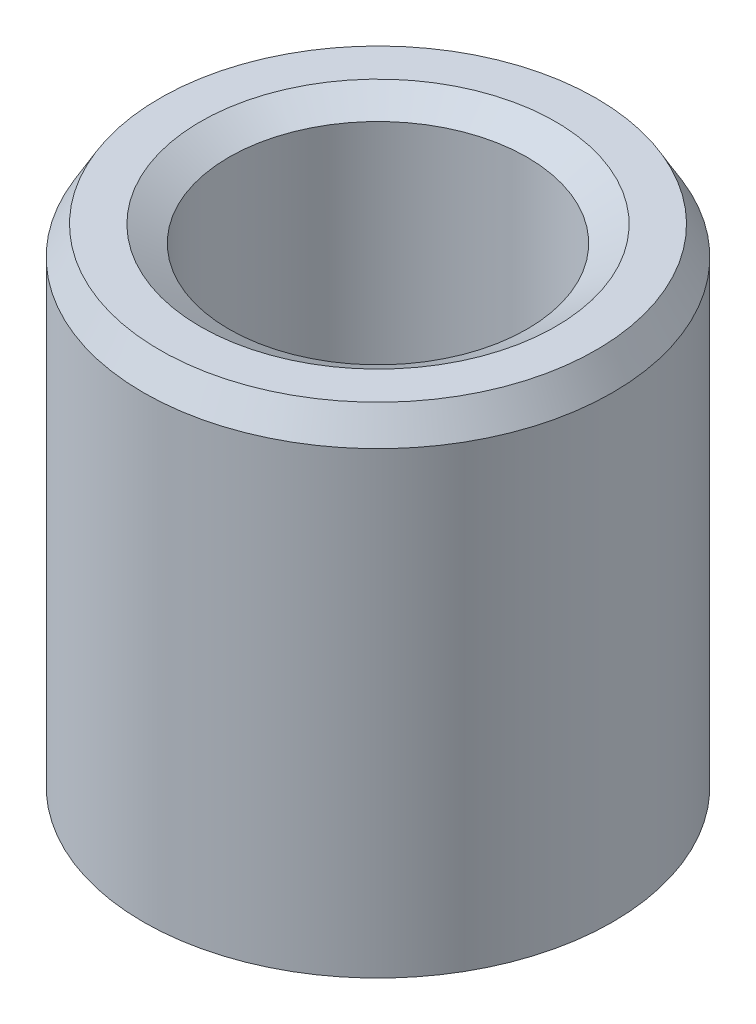
ISO-10303-21;
HEADER;
FILE_DESCRIPTION(('STEP AP214'),'2;1');
FILE_NAME('part.step','',(''),(''),'','','');
FILE_SCHEMA(('AUTOMOTIVE_DESIGN { 1 0 10303 214 1 1 1 1 }'));
ENDSEC;
DATA;
#1=APPLICATION_CONTEXT('core data for automotive mechanical design processes');
#2=APPLICATION_PROTOCOL_DEFINITION('international standard','automotive_design',2000,#1);
#3=PRODUCT_CONTEXT('',#1,'mechanical');
#4=PRODUCT('Part','Part','',(#3));
#5=PRODUCT_RELATED_PRODUCT_CATEGORY('part','',(#4));
#6=PRODUCT_DEFINITION_FORMATION('','',#4);
#7=PRODUCT_DEFINITION_CONTEXT('part definition',#1,'design');
#8=PRODUCT_DEFINITION('design','',#6,#7);
#9=PRODUCT_DEFINITION_SHAPE('','',#8);
#10=(LENGTH_UNIT() NAMED_UNIT(*) SI_UNIT(.MILLI.,.METRE.));
#11=(NAMED_UNIT(*) PLANE_ANGLE_UNIT() SI_UNIT($,.RADIAN.));
#12=(NAMED_UNIT(*) SI_UNIT($,.STERADIAN.) SOLID_ANGLE_UNIT());
#13=UNCERTAINTY_MEASURE_WITH_UNIT(LENGTH_MEASURE(1.E-05),#10,'distance_accuracy_value','');
#14=(GEOMETRIC_REPRESENTATION_CONTEXT(3) GLOBAL_UNCERTAINTY_ASSIGNED_CONTEXT((#13)) GLOBAL_UNIT_ASSIGNED_CONTEXT((#10,
#11,#12)) REPRESENTATION_CONTEXT('',''));
#15=CARTESIAN_POINT('',(0.,0.,0.));
#16=DIRECTION('',(0.,0.,1.));
#17=DIRECTION('',(1.,0.,0.));
#18=AXIS2_PLACEMENT_3D('',#15,#16,#17);
#19=CARTESIAN_POINT('',(0.,16.0942408762758,0.));
#20=DIRECTION('',(0.,-1.,0.));
#21=DIRECTION('',(0.,0.,-1.));
#22=AXIS2_PLACEMENT_3D('',#19,#20,#21);
#23=CYLINDRICAL_SURFACE('',#22,7.5);
#24=CARTESIAN_POINT('',(0.,0.527142682850933,0.));
#25=DIRECTION('',(0.,1.,0.));
#26=DIRECTION('',(0.,0.,1.));
#27=AXIS2_PLACEMENT_3D('',#24,#25,#26);
#28=CIRCLE('',#27,7.5);
#29=CARTESIAN_POINT('',(0.,0.527142682850933,7.5));
#30=VERTEX_POINT('',#29);
#31=EDGE_CURVE('E10',#30,#30,#28,.T.);
#32=ORIENTED_EDGE('',*,*,#31,.T.);
#33=EDGE_LOOP('',(#32));
#34=FACE_BOUND('',#33,.T.);
#35=CARTESIAN_POINT('',(0.,15.1812029667398,0.));
#36=DIRECTION('',(0.,1.,0.));
#37=DIRECTION('',(0.,0.,1.));
#38=AXIS2_PLACEMENT_3D('',#35,#36,#37);
#39=CIRCLE('',#38,7.5);
#40=CARTESIAN_POINT('',(0.,15.1812029667398,-7.5));
#41=VERTEX_POINT('',#40);
#42=EDGE_CURVE('E50',#41,#41,#39,.F.);
#43=ORIENTED_EDGE('',*,*,#42,.T.);
#44=EDGE_LOOP('',(#43));
#45=FACE_BOUND('',#44,.T.);
#46=ADVANCED_FACE('F39',(#34,#45),#23,.T.);
#47=CARTESIAN_POINT('',(0.,16.0942408762758,0.));
#48=DIRECTION('',(0.,1.,0.));
#49=DIRECTION('',(0.,0.,1.));
#50=AXIS2_PLACEMENT_3D('',#47,#48,#49);
#51=PLANE('',#50);
#52=CARTESIAN_POINT('',(0.,16.0942408762758,0.));
#53=DIRECTION('',(0.,1.,0.));
#54=DIRECTION('',(0.,0.,1.));
#55=AXIS2_PLACEMENT_3D('',#52,#53,#54);
#56=CIRCLE('',#55,5.67574141348441);
#57=CARTESIAN_POINT('',(0.,16.0942408762758,5.67574141348441));
#58=VERTEX_POINT('',#57);
#59=EDGE_CURVE('E58',#58,#58,#56,.F.);
#60=ORIENTED_EDGE('',*,*,#59,.T.);
#61=EDGE_LOOP('',(#60));
#62=FACE_BOUND('',#61,.T.);
#63=CARTESIAN_POINT('',(0.,16.0942408762758,0.));
#64=DIRECTION('',(0.,1.,0.));
#65=DIRECTION('',(0.,0.,1.));
#66=AXIS2_PLACEMENT_3D('',#63,#64,#65);
#67=CIRCLE('',#66,6.97285731714907);
#68=CARTESIAN_POINT('',(0.,16.0942408762758,-6.97285731714907));
#69=VERTEX_POINT('',#68);
#70=EDGE_CURVE('E61',#69,#69,#67,.T.);
#71=ORIENTED_EDGE('',*,*,#70,.T.);
#72=EDGE_LOOP('',(#71));
#73=FACE_BOUND('',#72,.T.);
#74=ADVANCED_FACE('F88',(#62,#73),#51,.T.);
#75=CARTESIAN_POINT('',(0.,0.,0.));
#76=DIRECTION('',(0.,1.,0.));
#77=DIRECTION('',(0.,0.,1.));
#78=AXIS2_PLACEMENT_3D('',#75,#76,#77);
#79=PLANE('',#78);
#80=CARTESIAN_POINT('',(0.,0.,0.));
#81=DIRECTION('',(0.,1.,0.));
#82=DIRECTION('',(0.,0.,1.));
#83=AXIS2_PLACEMENT_3D('',#80,#81,#82);
#84=CIRCLE('',#83,5.28984618679936);
#85=CARTESIAN_POINT('',(0.,0.,-5.28984618679936));
#86=VERTEX_POINT('',#85);
#87=EDGE_CURVE('E51',#86,#86,#84,.T.);
#88=ORIENTED_EDGE('',*,*,#87,.T.);
#89=EDGE_LOOP('',(#88));
#90=FACE_BOUND('',#89,.T.);
#91=CARTESIAN_POINT('',(0.,0.,0.));
#92=DIRECTION('',(0.,1.,0.));
#93=DIRECTION('',(0.,0.,1.));
#94=AXIS2_PLACEMENT_3D('',#91,#92,#93);
#95=CIRCLE('',#94,6.58696209046401);
#96=CARTESIAN_POINT('',(0.,0.,6.58696209046401));
#97=VERTEX_POINT('',#96);
#98=EDGE_CURVE('E54',#97,#97,#95,.F.);
#99=ORIENTED_EDGE('',*,*,#98,.T.);
#100=EDGE_LOOP('',(#99));
#101=FACE_BOUND('',#100,.T.);
#102=ADVANCED_FACE('F83',(#90,#101),#79,.F.);
#103=CARTESIAN_POINT('',(0.,16.0942408762758,0.));
#104=DIRECTION('',(0.,-1.,0.));
#105=DIRECTION('',(0.,0.,-1.));
#106=AXIS2_PLACEMENT_3D('',#103,#104,#105);
#107=CYLINDRICAL_SURFACE('',#106,4.76270350394843);
#108=CARTESIAN_POINT('',(0.,15.5670981934249,0.));
#109=DIRECTION('',(0.,1.,0.));
#110=DIRECTION('',(0.,0.,1.));
#111=AXIS2_PLACEMENT_3D('',#108,#109,#110);
#112=CIRCLE('',#111,4.76270350394843);
#113=CARTESIAN_POINT('',(0.,15.5670981934249,4.76270350394843));
#114=VERTEX_POINT('',#113);
#115=EDGE_CURVE('E67',#114,#114,#112,.T.);
#116=ORIENTED_EDGE('',*,*,#115,.T.);
#117=EDGE_LOOP('',(#116));
#118=FACE_BOUND('',#117,.T.);
#119=CARTESIAN_POINT('',(0.,0.913037909535985,0.));
#120=DIRECTION('',(0.,1.,0.));
#121=DIRECTION('',(0.,0.,1.));
#122=AXIS2_PLACEMENT_3D('',#119,#120,#121);
#123=CIRCLE('',#122,4.76270350394843);
#124=CARTESIAN_POINT('',(0.,0.913037909535985,-4.76270350394843));
#125=VERTEX_POINT('',#124);
#126=EDGE_CURVE('E69',#125,#125,#123,.F.);
#127=ORIENTED_EDGE('',*,*,#126,.T.);
#128=EDGE_LOOP('',(#127));
#129=FACE_BOUND('',#128,.T.);
#130=ADVANCED_FACE('F71',(#118,#129),#107,.F.);
#131=CARTESIAN_POINT('',(0.,15.5670981934249,0.));
#132=DIRECTION('',(0.,1.,0.));
#133=DIRECTION('',(0.,0.,1.));
#134=AXIS2_PLACEMENT_3D('',#131,#132,#133);
#135=CONICAL_SURFACE('',#134,4.76270350394843,1.0471975511966);
#136=ORIENTED_EDGE('',*,*,#59,.F.);
#137=EDGE_LOOP('',(#136));
#138=FACE_BOUND('',#137,.T.);
#139=ORIENTED_EDGE('',*,*,#115,.F.);
#140=EDGE_LOOP('',(#139));
#141=FACE_BOUND('',#140,.T.);
#142=ADVANCED_FACE('F77',(#138,#141),#135,.F.);
#143=CARTESIAN_POINT('',(0.,0.,0.));
#144=DIRECTION('',(0.,-1.,0.));
#145=DIRECTION('',(0.,0.,-1.));
#146=AXIS2_PLACEMENT_3D('',#143,#144,#145);
#147=CONICAL_SURFACE('',#146,5.28984618679936,0.523598775598297);
#148=CARTESIAN_POINT('',(0.,0.913037909535985,-4.76270350394843));
#149=CARTESIAN_POINT('',(0.,0.903527097978318,-4.76819457356146));
#150=CARTESIAN_POINT('',(0.,0.894016286420652,-4.77368564317449));
#151=CARTESIAN_POINT('',(0.,0.874994663305319,-4.78466778240055));
#152=CARTESIAN_POINT('',(0.,0.865483851747652,-4.79015885201358));
#153=CARTESIAN_POINT('',(0.,0.846462228632319,-4.80114099123964));
#154=CARTESIAN_POINT('',(0.,0.836951417074653,-4.80663206085267));
#155=CARTESIAN_POINT('',(0.,0.81792979395932,-4.81761420007873));
#156=CARTESIAN_POINT('',(0.,0.808418982401653,-4.82310526969176));
#157=CARTESIAN_POINT('',(0.,0.78939735928632,-4.83408740891782));
#158=CARTESIAN_POINT('',(0.,0.779886547728654,-4.83957847853085));
#159=CARTESIAN_POINT('',(0.,0.760864924613321,-4.85056061775692));
#160=CARTESIAN_POINT('',(0.,0.751354113055654,-4.85605168736995));
#161=CARTESIAN_POINT('',(0.,0.732332489940321,-4.86703382659601));
#162=CARTESIAN_POINT('',(0.,0.722821678382655,-4.87252489620904));
#163=CARTESIAN_POINT('',(0.,0.703800055267322,-4.8835070354351));
#164=CARTESIAN_POINT('',(0.,0.694289243709655,-4.88899810504813));
#165=CARTESIAN_POINT('',(0.,0.675267620594322,-4.89998024427419));
#166=CARTESIAN_POINT('',(0.,0.665756809036656,-4.90547131388722));
#167=CARTESIAN_POINT('',(0.,0.646735185921323,-4.91645345311328));
#168=CARTESIAN_POINT('',(0.,0.637224374363656,-4.92194452272631));
#169=CARTESIAN_POINT('',(0.,0.618202751248323,-4.93292666195237));
#170=CARTESIAN_POINT('',(0.,0.608691939690656,-4.9384177315654));
#171=CARTESIAN_POINT('',(0.,0.589670316575324,-4.94939987079146));
#172=CARTESIAN_POINT('',(0.,0.580159505017657,-4.9548909404045));
#173=CARTESIAN_POINT('',(0.,0.561137881902324,-4.96587307963056));
#174=CARTESIAN_POINT('',(0.,0.551627070344657,-4.97136414924359));
#175=CARTESIAN_POINT('',(0.,0.532605447229324,-4.98234628846965));
#176=CARTESIAN_POINT('',(0.,0.523094635671658,-4.98783735808268));
#177=CARTESIAN_POINT('',(0.,0.504073012556325,-4.99881949730874));
#178=CARTESIAN_POINT('',(0.,0.494562200998658,-5.00431056692177));
#179=CARTESIAN_POINT('',(0.,0.475540577883326,-5.01529270614783));
#180=CARTESIAN_POINT('',(0.,0.466029766325659,-5.02078377576086));
#181=CARTESIAN_POINT('',(0.,0.447008143210326,-5.03176591498692));
#182=CARTESIAN_POINT('',(0.,0.437497331652659,-5.03725698459995));
#183=CARTESIAN_POINT('',(0.,0.418475708537326,-5.04823912382601));
#184=CARTESIAN_POINT('',(0.,0.40896489697966,-5.05373019343905));
#185=CARTESIAN_POINT('',(0.,0.389943273864327,-5.06471233266511));
#186=CARTESIAN_POINT('',(0.,0.38043246230666,-5.07020340227814));
#187=CARTESIAN_POINT('',(0.,0.361410839191327,-5.0811855415042));
#188=CARTESIAN_POINT('',(0.,0.351900027633661,-5.08667661111723));
#189=CARTESIAN_POINT('',(0.,0.332878404518328,-5.09765875034329));
#190=CARTESIAN_POINT('',(0.,0.323367592960661,-5.10314981995632));
#191=CARTESIAN_POINT('',(0.,0.304345969845328,-5.11413195918238));
#192=CARTESIAN_POINT('',(0.,0.294835158287662,-5.11962302879541));
#193=CARTESIAN_POINT('',(0.,0.275813535172329,-5.13060516802147));
#194=CARTESIAN_POINT('',(0.,0.266302723614662,-5.1360962376345));
#195=CARTESIAN_POINT('',(0.,0.247281100499329,-5.14707837686056));
#196=CARTESIAN_POINT('',(0.,0.237770288941663,-5.15256944647359));
#197=CARTESIAN_POINT('',(0.,0.21874866582633,-5.16355158569966));
#198=CARTESIAN_POINT('',(0.,0.209237854268663,-5.16904265531269));
#199=CARTESIAN_POINT('',(0.,0.19021623115333,-5.18002479453875));
#200=CARTESIAN_POINT('',(0.,0.180705419595664,-5.18551586415178));
#201=CARTESIAN_POINT('',(0.,0.161683796480331,-5.19649800337784));
#202=CARTESIAN_POINT('',(0.,0.152172984922664,-5.20198907299087));
#203=CARTESIAN_POINT('',(0.,0.133151361807331,-5.21297121221693));
#204=CARTESIAN_POINT('',(0.,0.123640550249665,-5.21846228182996));
#205=CARTESIAN_POINT('',(0.,0.104618927134332,-5.22944442105602));
#206=CARTESIAN_POINT('',(0.,0.0951081155766651,-5.23493549066905));
#207=CARTESIAN_POINT('',(0.,0.076086492461332,-5.24591762989511));
#208=CARTESIAN_POINT('',(0.,0.0665756809036655,-5.25140869950814));
#209=CARTESIAN_POINT('',(0.,0.0475540577883325,-5.2623908387342));
#210=CARTESIAN_POINT('',(0.,0.0380432462306661,-5.26788190834724));
#211=CARTESIAN_POINT('',(0.,0.0190216231153332,-5.2788640475733));
#212=CARTESIAN_POINT('',(0.,0.00951081155766673,-5.28435511718633));
#213=CARTESIAN_POINT('',(0.,0.,-5.28984618679936));
#214=B_SPLINE_CURVE_WITH_KNOTS('',3,(#148,#149,#150,#151,#152,#153,#154,#155,#156,#157,#158,
#159,#160,#161,#162,#163,#164,#165,#166,#167,#168,#169,#170,#171,#172,#173,#174,#175,#176,#177,
#178,#179,#180,#181,#182,#183,#184,#185,#186,#187,#188,#189,#190,#191,#192,#193,#194,#195,#196,
#197,#198,#199,#200,#201,#202,#203,#204,#205,#206,#207,#208,#209,#210,#211,#212,#213),
.UNSPECIFIED.,.F.,.F.,(4,2,2,2,2,2,2,2,2,2,2,2,2,2,2,2,2,2,2,2,2,2,2,2,2,2,2,2,2,2,2,2,4),(0.,
0.0329464176781833,0.0658928353563668,0.09883925303455,0.131785670712733,0.164732088390917,
0.1976785060691,0.230624923747283,0.263571341425467,0.29651775910365,0.329464176781833,
0.362410594460017,0.3953570121382,0.428303429816383,0.461249847494567,0.49419626517275,
0.527142682850933,0.560089100529117,0.5930355182073,0.625981935885483,0.658928353563667,
0.69187477124185,0.724821188920033,0.757767606598217,0.7907140242764,0.823660441954583,
0.856606859632767,0.88955327731095,0.922499694989133,0.955446112667316,0.9883925303455,
1.02133894802368,1.05428536570187),.UNSPECIFIED.);
#215=EDGE_CURVE('BSEAM73',#125,#86,#214,.T.);
#216=ORIENTED_EDGE('',*,*,#126,.F.);
#217=ORIENTED_EDGE('',*,*,#87,.F.);
#218=ORIENTED_EDGE('',*,*,#215,.T.);
#219=ORIENTED_EDGE('',*,*,#215,.F.);
#220=EDGE_LOOP('',(#216,#218,#217,#219));
#221=FACE_BOUND('',#220,.T.);
#222=ADVANCED_FACE('F73',(#221),#147,.F.);
#223=CARTESIAN_POINT('',(0.,0.527142682850933,0.));
#224=DIRECTION('',(0.,1.,0.));
#225=DIRECTION('',(0.,0.,1.));
#226=AXIS2_PLACEMENT_3D('',#223,#224,#225);
#227=CONICAL_SURFACE('',#226,7.5,1.0471975511966);
#228=ORIENTED_EDGE('',*,*,#98,.F.);
#229=EDGE_LOOP('',(#228));
#230=FACE_BOUND('',#229,.T.);
#231=ORIENTED_EDGE('',*,*,#31,.F.);
#232=EDGE_LOOP('',(#231));
#233=FACE_BOUND('',#232,.T.);
#234=ADVANCED_FACE('F76',(#230,#233),#227,.T.);
#235=CARTESIAN_POINT('',(0.,16.0942408762758,0.));
#236=DIRECTION('',(0.,-1.,0.));
#237=DIRECTION('',(0.,0.,-1.));
#238=AXIS2_PLACEMENT_3D('',#235,#236,#237);
#239=CONICAL_SURFACE('',#238,6.97285731714907,0.523598775598294);
#240=CARTESIAN_POINT('',(0.,15.1812029667398,-7.5));
#241=CARTESIAN_POINT('',(0.,15.1907137782975,-7.49450893038697));
#242=CARTESIAN_POINT('',(0.,15.2002245898551,-7.48901786077394));
#243=CARTESIAN_POINT('',(0.,15.2192462129705,-7.47803572154788));
#244=CARTESIAN_POINT('',(0.,15.2287570245281,-7.47254465193485));
#245=CARTESIAN_POINT('',(0.,15.2477786476435,-7.46156251270879));
#246=CARTESIAN_POINT('',(0.,15.2572894592011,-7.45607144309576));
#247=CARTESIAN_POINT('',(0.,15.2763110823165,-7.4450893038697));
#248=CARTESIAN_POINT('',(0.,15.2858218938741,-7.43959823425666));
#249=CARTESIAN_POINT('',(0.,15.3048435169895,-7.4286160950306));
#250=CARTESIAN_POINT('',(0.,15.3143543285471,-7.42312502541757));
#251=CARTESIAN_POINT('',(0.,15.3333759516625,-7.41214288619151));
#252=CARTESIAN_POINT('',(0.,15.3428867632201,-7.40665181657848));
#253=CARTESIAN_POINT('',(0.,15.3619083863355,-7.39566967735242));
#254=CARTESIAN_POINT('',(0.,15.3714191978931,-7.39017860773939));
#255=CARTESIAN_POINT('',(0.,15.3904408210085,-7.37919646851333));
#256=CARTESIAN_POINT('',(0.,15.3999516325661,-7.3737053989003));
#257=CARTESIAN_POINT('',(0.,15.4189732556815,-7.36272325967424));
#258=CARTESIAN_POINT('',(0.,15.4284840672391,-7.35723219006121));
#259=CARTESIAN_POINT('',(0.,15.4475056903545,-7.34625005083515));
#260=CARTESIAN_POINT('',(0.,15.4570165019121,-7.34075898122212));
#261=CARTESIAN_POINT('',(0.,15.4760381250275,-7.32977684199605));
#262=CARTESIAN_POINT('',(0.,15.4855489365851,-7.32428577238302));
#263=CARTESIAN_POINT('',(0.,15.5045705597005,-7.31330363315696));
#264=CARTESIAN_POINT('',(0.,15.5140813712581,-7.30781256354393));
#265=CARTESIAN_POINT('',(0.,15.5331029943735,-7.29683042431787));
#266=CARTESIAN_POINT('',(0.,15.5426138059311,-7.29133935470484));
#267=CARTESIAN_POINT('',(0.,15.5616354290465,-7.28035721547878));
#268=CARTESIAN_POINT('',(0.,15.5711462406041,-7.27486614586575));
#269=CARTESIAN_POINT('',(0.,15.5901678637195,-7.26388400663969));
#270=CARTESIAN_POINT('',(0.,15.5996786752771,-7.25839293702666));
#271=CARTESIAN_POINT('',(0.,15.6187002983925,-7.2474107978006));
#272=CARTESIAN_POINT('',(0.,15.6282111099501,-7.24191972818757));
#273=CARTESIAN_POINT('',(0.,15.6472327330655,-7.23093758896151));
#274=CARTESIAN_POINT('',(0.,15.6567435446231,-7.22544651934848));
#275=CARTESIAN_POINT('',(0.,15.6757651677385,-7.21446438012241));
#276=CARTESIAN_POINT('',(0.,15.6852759792961,-7.20897331050938));
#277=CARTESIAN_POINT('',(0.,15.7042976024115,-7.19799117128332));
#278=CARTESIAN_POINT('',(0.,15.7138084139691,-7.19250010167029));
#279=CARTESIAN_POINT('',(0.,15.7328300370845,-7.18151796244423));
#280=CARTESIAN_POINT('',(0.,15.7423408486421,-7.1760268928312));
#281=CARTESIAN_POINT('',(0.,15.7613624717575,-7.16504475360514));
#282=CARTESIAN_POINT('',(0.,15.7708732833151,-7.15955368399211));
#283=CARTESIAN_POINT('',(0.,15.7898949064305,-7.14857154476605));
#284=CARTESIAN_POINT('',(0.,15.7994057179881,-7.14308047515302));
#285=CARTESIAN_POINT('',(0.,15.8184273411035,-7.13209833592696));
#286=CARTESIAN_POINT('',(0.,15.8279381526611,-7.12660726631393));
#287=CARTESIAN_POINT('',(0.,15.8469597757765,-7.11562512708787));
#288=CARTESIAN_POINT('',(0.,15.8564705873341,-7.11013405747483));
#289=CARTESIAN_POINT('',(0.,15.8754922104495,-7.09915191824877));
#290=CARTESIAN_POINT('',(0.,15.8850030220071,-7.09366084863574));
#291=CARTESIAN_POINT('',(0.,15.9040246451225,-7.08267870940968));
#292=CARTESIAN_POINT('',(0.,15.9135354566801,-7.07718763979665));
#293=CARTESIAN_POINT('',(0.,15.9325570797955,-7.06620550057059));
#294=CARTESIAN_POINT('',(0.,15.9420678913531,-7.06071443095756));
#295=CARTESIAN_POINT('',(0.,15.9610895144685,-7.0497322917315));
#296=CARTESIAN_POINT('',(0.,15.9706003260261,-7.04424122211847));
#297=CARTESIAN_POINT('',(0.,15.9896219491414,-7.03325908289241));
#298=CARTESIAN_POINT('',(0.,15.9991327606991,-7.02776801327938));
#299=CARTESIAN_POINT('',(0.,16.0181543838144,-7.01678587405332));
#300=CARTESIAN_POINT('',(0.,16.0276651953721,-7.01129480444029));
#301=CARTESIAN_POINT('',(0.,16.0466868184874,-7.00031266521423));
#302=CARTESIAN_POINT('',(0.,16.0561976300451,-6.99482159560119));
#303=CARTESIAN_POINT('',(0.,16.0752192531604,-6.98383945637513));
#304=CARTESIAN_POINT('',(0.,16.0847300647181,-6.9783483867621));
#305=CARTESIAN_POINT('',(0.,16.0942408762758,-6.97285731714907));
#306=B_SPLINE_CURVE_WITH_KNOTS('',3,(#240,#241,#242,#243,#244,#245,#246,#247,#248,#249,#250,
#251,#252,#253,#254,#255,#256,#257,#258,#259,#260,#261,#262,#263,#264,#265,#266,#267,#268,#269,
#270,#271,#272,#273,#274,#275,#276,#277,#278,#279,#280,#281,#282,#283,#284,#285,#286,#287,#288,
#289,#290,#291,#292,#293,#294,#295,#296,#297,#298,#299,#300,#301,#302,#303,#304,#305),
.UNSPECIFIED.,.F.,.F.,(4,2,2,2,2,2,2,2,2,2,2,2,2,2,2,2,2,2,2,2,2,2,2,2,2,2,2,2,2,2,2,2,4),(0.,
0.0329464176781823,0.0658928353563661,0.0988392530345484,0.131785670712732,0.164732088390915,
0.197678506069098,0.230624923747283,0.263571341425465,0.296517759103649,0.329464176781831,
0.362410594460015,0.395357012138199,0.428303429816381,0.461249847494565,0.494196265172748,
0.527142682850931,0.560089100529115,0.593035518207296,0.62598193588548,0.658928353563664,
0.691874771241848,0.724821188920031,0.757767606598212,0.790714024276396,0.82366044195458,
0.856606859632764,0.889553277310948,0.922499694989129,0.955446112667312,0.988392530345497,
1.02133894802368,1.05428536570186),.UNSPECIFIED.);
#307=EDGE_CURVE('BSEAM45',#41,#69,#306,.T.);
#308=ORIENTED_EDGE('',*,*,#42,.F.);
#309=ORIENTED_EDGE('',*,*,#70,.F.);
#310=ORIENTED_EDGE('',*,*,#307,.T.);
#311=ORIENTED_EDGE('',*,*,#307,.F.);
#312=EDGE_LOOP('',(#308,#310,#309,#311));
#313=FACE_BOUND('',#312,.T.);
#314=ADVANCED_FACE('F45',(#313),#239,.T.);
#315=CLOSED_SHELL('',(#46,#74,#102,#130,#142,#222,#234,#314));
#316=MANIFOLD_SOLID_BREP('B2',#315);
#317=ADVANCED_BREP_SHAPE_REPRESENTATION('',(#18,#316),#14);
#318=SHAPE_DEFINITION_REPRESENTATION(#9,#317);
ENDSEC;
END-ISO-10303-21;
